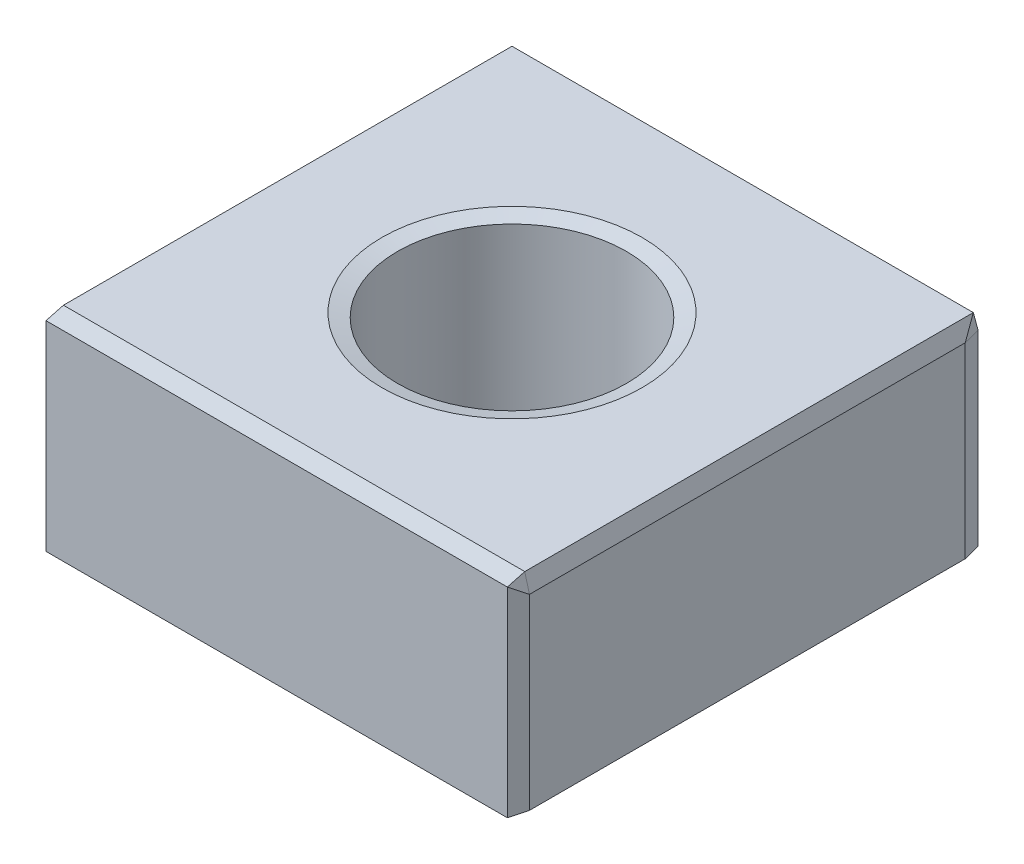
ISO-10303-21;
HEADER;
FILE_DESCRIPTION(('STEP AP214'),'2;1');
FILE_NAME('part.step','',(''),(''),'','','');
FILE_SCHEMA(('AUTOMOTIVE_DESIGN { 1 0 10303 214 1 1 1 1 }'));
ENDSEC;
DATA;
#1=APPLICATION_CONTEXT('core data for automotive mechanical design processes');
#2=APPLICATION_PROTOCOL_DEFINITION('international standard','automotive_design',2000,#1);
#3=PRODUCT_CONTEXT('',#1,'mechanical');
#4=PRODUCT('Part','Part','',(#3));
#5=PRODUCT_RELATED_PRODUCT_CATEGORY('part','',(#4));
#6=PRODUCT_DEFINITION_FORMATION('','',#4);
#7=PRODUCT_DEFINITION_CONTEXT('part definition',#1,'design');
#8=PRODUCT_DEFINITION('design','',#6,#7);
#9=PRODUCT_DEFINITION_SHAPE('','',#8);
#10=(LENGTH_UNIT() NAMED_UNIT(*) SI_UNIT(.MILLI.,.METRE.));
#11=(NAMED_UNIT(*) PLANE_ANGLE_UNIT() SI_UNIT($,.RADIAN.));
#12=(NAMED_UNIT(*) SI_UNIT($,.STERADIAN.) SOLID_ANGLE_UNIT());
#13=UNCERTAINTY_MEASURE_WITH_UNIT(LENGTH_MEASURE(1.E-05),#10,'distance_accuracy_value','');
#14=(GEOMETRIC_REPRESENTATION_CONTEXT(3) GLOBAL_UNCERTAINTY_ASSIGNED_CONTEXT((#13)) GLOBAL_UNIT_ASSIGNED_CONTEXT((#10,
#11,#12)) REPRESENTATION_CONTEXT('',''));
#15=CARTESIAN_POINT('',(0.,0.,0.));
#16=DIRECTION('',(0.,0.,1.));
#17=DIRECTION('',(1.,0.,0.));
#18=AXIS2_PLACEMENT_3D('',#15,#16,#17);
#19=CARTESIAN_POINT('',(-27.,24.,27.));
#20=DIRECTION('',(1.,0.,0.));
#21=DIRECTION('',(0.,0.,-1.));
#22=AXIS2_PLACEMENT_3D('',#19,#20,#21);
#23=PLANE('',#22);
#24=DIRECTION('',(0.,0.,-1.));
#25=VECTOR('',#24,1.);
#26=CARTESIAN_POINT('',(-27.,22.,-27.));
#27=LINE('',#26,#25);
#28=CARTESIAN_POINT('',(-27.,22.,25.));
#29=VERTEX_POINT('',#28);
#30=CARTESIAN_POINT('',(-27.,22.,-26.4641016151377));
#31=VERTEX_POINT('',#30);
#32=EDGE_CURVE('E136',#29,#31,#27,.T.);
#33=ORIENTED_EDGE('',*,*,#32,.T.);
#34=DIRECTION('',(0.,-1.,0.));
#35=VECTOR('',#34,1.);
#36=CARTESIAN_POINT('',(-27.,24.,-26.4641016151377));
#37=LINE('',#36,#35);
#38=CARTESIAN_POINT('',(-27.,0.535898384862246,-26.4641016151377));
#39=VERTEX_POINT('',#38);
#40=EDGE_CURVE('E181',#31,#39,#37,.T.);
#41=ORIENTED_EDGE('',*,*,#40,.T.);
#42=DIRECTION('',(0.,0.,1.));
#43=VECTOR('',#42,1.);
#44=CARTESIAN_POINT('',(-27.,0.535898384862246,27.));
#45=LINE('',#44,#43);
#46=CARTESIAN_POINT('',(-27.,0.535898384862246,25.));
#47=VERTEX_POINT('',#46);
#48=EDGE_CURVE('E172',#39,#47,#45,.T.);
#49=ORIENTED_EDGE('',*,*,#48,.T.);
#50=DIRECTION('',(0.,1.,0.));
#51=VECTOR('',#50,1.);
#52=CARTESIAN_POINT('',(-27.,24.,25.));
#53=LINE('',#52,#51);
#54=EDGE_CURVE('E168',#47,#29,#53,.T.);
#55=ORIENTED_EDGE('',*,*,#54,.T.);
#56=EDGE_LOOP('',(#33,#41,#49,#55));
#57=FACE_BOUND('',#56,.T.);
#58=ADVANCED_FACE('F39',(#57),#23,.F.);
#59=CARTESIAN_POINT('',(27.,24.,27.));
#60=DIRECTION('',(0.,0.,-1.));
#61=DIRECTION('',(-1.,0.,0.));
#62=AXIS2_PLACEMENT_3D('',#59,#60,#61);
#63=PLANE('',#62);
#64=DIRECTION('',(-1.,0.,0.));
#65=VECTOR('',#64,1.);
#66=CARTESIAN_POINT('',(-27.,23.4641016151378,27.));
#67=LINE('',#66,#65);
#68=CARTESIAN_POINT('',(26.4641016151378,23.4641016151378,27.));
#69=VERTEX_POINT('',#68);
#70=CARTESIAN_POINT('',(-26.4641016151377,23.4641016151378,27.));
#71=VERTEX_POINT('',#70);
#72=EDGE_CURVE('E55',#69,#71,#67,.T.);
#73=ORIENTED_EDGE('',*,*,#72,.T.);
#74=DIRECTION('',(0.,-1.,0.));
#75=VECTOR('',#74,1.);
#76=CARTESIAN_POINT('',(-26.4641016151377,24.,27.));
#77=LINE('',#76,#75);
#78=CARTESIAN_POINT('',(-26.4641016151377,0.535898384862246,27.));
#79=VERTEX_POINT('',#78);
#80=EDGE_CURVE('E230',#71,#79,#77,.T.);
#81=ORIENTED_EDGE('',*,*,#80,.T.);
#82=DIRECTION('',(1.,0.,0.));
#83=VECTOR('',#82,1.);
#84=CARTESIAN_POINT('',(27.,0.535898384862246,27.));
#85=LINE('',#84,#83);
#86=CARTESIAN_POINT('',(26.4641016151378,0.535898384862246,27.));
#87=VERTEX_POINT('',#86);
#88=EDGE_CURVE('E223',#79,#87,#85,.T.);
#89=ORIENTED_EDGE('',*,*,#88,.T.);
#90=DIRECTION('',(0.,1.,0.));
#91=VECTOR('',#90,1.);
#92=CARTESIAN_POINT('',(26.4641016151378,24.,27.));
#93=LINE('',#92,#91);
#94=EDGE_CURVE('E60',#87,#69,#93,.T.);
#95=ORIENTED_EDGE('',*,*,#94,.T.);
#96=EDGE_LOOP('',(#73,#81,#89,#95));
#97=FACE_BOUND('',#96,.T.);
#98=ADVANCED_FACE('F413',(#97),#63,.F.);
#99=CARTESIAN_POINT('',(27.,24.,27.));
#100=DIRECTION('',(-1.,0.,0.));
#101=DIRECTION('',(0.,0.,1.));
#102=AXIS2_PLACEMENT_3D('',#99,#100,#101);
#103=PLANE('',#102);
#104=DIRECTION('',(0.,1.,0.));
#105=VECTOR('',#104,1.);
#106=CARTESIAN_POINT('',(27.,24.,-25.));
#107=LINE('',#106,#105);
#108=CARTESIAN_POINT('',(27.,0.535898384862246,-25.));
#109=VERTEX_POINT('',#108);
#110=CARTESIAN_POINT('',(27.,22.,-25.));
#111=VERTEX_POINT('',#110);
#112=EDGE_CURVE('E216',#109,#111,#107,.T.);
#113=ORIENTED_EDGE('',*,*,#112,.T.);
#114=DIRECTION('',(0.,0.,1.));
#115=VECTOR('',#114,1.);
#116=CARTESIAN_POINT('',(27.,22.,27.));
#117=LINE('',#116,#115);
#118=CARTESIAN_POINT('',(27.,22.,25.));
#119=VERTEX_POINT('',#118);
#120=EDGE_CURVE('E219',#111,#119,#117,.T.);
#121=ORIENTED_EDGE('',*,*,#120,.T.);
#122=DIRECTION('',(0.,-1.,0.));
#123=VECTOR('',#122,1.);
#124=CARTESIAN_POINT('',(27.,24.,25.));
#125=LINE('',#124,#123);
#126=CARTESIAN_POINT('',(27.,0.535898384862246,25.));
#127=VERTEX_POINT('',#126);
#128=EDGE_CURVE('E210',#119,#127,#125,.T.);
#129=ORIENTED_EDGE('',*,*,#128,.T.);
#130=DIRECTION('',(0.,0.,-1.));
#131=VECTOR('',#130,1.);
#132=CARTESIAN_POINT('',(27.,0.535898384862246,27.));
#133=LINE('',#132,#131);
#134=EDGE_CURVE('E213',#127,#109,#133,.T.);
#135=ORIENTED_EDGE('',*,*,#134,.T.);
#136=EDGE_LOOP('',(#113,#121,#129,#135));
#137=FACE_BOUND('',#136,.T.);
#138=ADVANCED_FACE('F411',(#137),#103,.F.);
#139=CARTESIAN_POINT('',(27.,24.,-27.));
#140=DIRECTION('',(0.,0.,1.));
#141=DIRECTION('',(1.,0.,0.));
#142=AXIS2_PLACEMENT_3D('',#139,#140,#141);
#143=PLANE('',#142);
#144=DIRECTION('',(0.,1.,0.));
#145=VECTOR('',#144,1.);
#146=CARTESIAN_POINT('',(-25.,24.,-27.));
#147=LINE('',#146,#145);
#148=CARTESIAN_POINT('',(-25.,0.535898384862246,-27.));
#149=VERTEX_POINT('',#148);
#150=CARTESIAN_POINT('',(-25.,22.,-27.));
#151=VERTEX_POINT('',#150);
#152=EDGE_CURVE('E203',#149,#151,#147,.T.);
#153=ORIENTED_EDGE('',*,*,#152,.T.);
#154=DIRECTION('',(1.,0.,0.));
#155=VECTOR('',#154,1.);
#156=CARTESIAN_POINT('',(27.,22.,-27.));
#157=LINE('',#156,#155);
#158=CARTESIAN_POINT('',(26.4641016151378,22.,-27.));
#159=VERTEX_POINT('',#158);
#160=EDGE_CURVE('E206',#151,#159,#157,.T.);
#161=ORIENTED_EDGE('',*,*,#160,.T.);
#162=DIRECTION('',(0.,-1.,0.));
#163=VECTOR('',#162,1.);
#164=CARTESIAN_POINT('',(26.4641016151378,24.,-27.));
#165=LINE('',#164,#163);
#166=CARTESIAN_POINT('',(26.4641016151378,0.535898384862246,-27.));
#167=VERTEX_POINT('',#166);
#168=EDGE_CURVE('E197',#159,#167,#165,.T.);
#169=ORIENTED_EDGE('',*,*,#168,.T.);
#170=DIRECTION('',(-1.,0.,0.));
#171=VECTOR('',#170,1.);
#172=CARTESIAN_POINT('',(27.,0.535898384862246,-27.));
#173=LINE('',#172,#171);
#174=EDGE_CURVE('E200',#167,#149,#173,.T.);
#175=ORIENTED_EDGE('',*,*,#174,.T.);
#176=EDGE_LOOP('',(#153,#161,#169,#175));
#177=FACE_BOUND('',#176,.T.);
#178=ADVANCED_FACE('F373',(#177),#143,.F.);
#179=CARTESIAN_POINT('',(0.,24.,0.));
#180=DIRECTION('',(0.,1.,0.));
#181=DIRECTION('',(0.,0.,1.));
#182=AXIS2_PLACEMENT_3D('',#179,#180,#181);
#183=PLANE('',#182);
#184=CARTESIAN_POINT('',(0.,24.,0.));
#185=DIRECTION('',(0.,1.,0.));
#186=DIRECTION('',(0.,0.,1.));
#187=AXIS2_PLACEMENT_3D('',#184,#185,#186);
#188=CIRCLE('',#187,14.93);
#189=CARTESIAN_POINT('',(0.,24.,14.93));
#190=VERTEX_POINT('',#189);
#191=EDGE_CURVE('E48',#190,#190,#188,.F.);
#192=ORIENTED_EDGE('',*,*,#191,.T.);
#193=EDGE_LOOP('',(#192));
#194=FACE_BOUND('',#193,.T.);
#195=DIRECTION('',(-1.,0.,0.));
#196=VECTOR('',#195,1.);
#197=CARTESIAN_POINT('',(-27.,24.,-26.4641016151377));
#198=LINE('',#197,#196);
#199=CARTESIAN_POINT('',(26.4641016151378,24.,-26.4641016151378));
#200=VERTEX_POINT('',#199);
#201=CARTESIAN_POINT('',(-26.4641016151377,24.,-26.4641016151377));
#202=VERTEX_POINT('',#201);
#203=EDGE_CURVE('E165',#200,#202,#198,.T.);
#204=ORIENTED_EDGE('',*,*,#203,.T.);
#205=DIRECTION('',(0.,0.,1.));
#206=VECTOR('',#205,1.);
#207=CARTESIAN_POINT('',(-26.4641016151377,24.,27.));
#208=LINE('',#207,#206);
#209=CARTESIAN_POINT('',(-26.4641016151377,24.,25.));
#210=VERTEX_POINT('',#209);
#211=EDGE_CURVE('E134',#202,#210,#208,.T.);
#212=ORIENTED_EDGE('',*,*,#211,.T.);
#213=DIRECTION('',(1.,0.,0.));
#214=VECTOR('',#213,1.);
#215=CARTESIAN_POINT('',(27.,24.,25.));
#216=LINE('',#215,#214);
#217=CARTESIAN_POINT('',(26.4641016151378,24.,25.));
#218=VERTEX_POINT('',#217);
#219=EDGE_CURVE('E153',#210,#218,#216,.T.);
#220=ORIENTED_EDGE('',*,*,#219,.T.);
#221=DIRECTION('',(0.,0.,-1.));
#222=VECTOR('',#221,1.);
#223=CARTESIAN_POINT('',(26.4641016151378,24.,-27.));
#224=LINE('',#223,#222);
#225=EDGE_CURVE('E160',#218,#200,#224,.T.);
#226=ORIENTED_EDGE('',*,*,#225,.T.);
#227=EDGE_LOOP('',(#204,#212,#220,#226));
#228=FACE_BOUND('',#227,.T.);
#229=ADVANCED_FACE('F163',(#194,#228),#183,.T.);
#230=CARTESIAN_POINT('',(0.,0.,0.));
#231=DIRECTION('',(0.,1.,0.));
#232=DIRECTION('',(0.,0.,1.));
#233=AXIS2_PLACEMENT_3D('',#230,#231,#232);
#234=PLANE('',#233);
#235=CARTESIAN_POINT('',(0.,0.,0.));
#236=DIRECTION('',(0.,1.,0.));
#237=DIRECTION('',(0.,0.,1.));
#238=AXIS2_PLACEMENT_3D('',#235,#236,#237);
#239=CIRCLE('',#238,13.612308546376);
#240=CARTESIAN_POINT('',(0.,0.,-13.612308546376));
#241=VERTEX_POINT('',#240);
#242=EDGE_CURVE('E11',#241,#241,#239,.T.);
#243=ORIENTED_EDGE('',*,*,#242,.T.);
#244=EDGE_LOOP('',(#243));
#245=FACE_BOUND('',#244,.T.);
#246=DIRECTION('',(-1.,0.,0.));
#247=VECTOR('',#246,1.);
#248=CARTESIAN_POINT('',(0.,0.,25.));
#249=LINE('',#248,#247);
#250=CARTESIAN_POINT('',(25.,0.,25.));
#251=VERTEX_POINT('',#250);
#252=CARTESIAN_POINT('',(-25.,0.,25.));
#253=VERTEX_POINT('',#252);
#254=EDGE_CURVE('E184',#251,#253,#249,.T.);
#255=ORIENTED_EDGE('',*,*,#254,.T.);
#256=DIRECTION('',(0.,0.,-1.));
#257=VECTOR('',#256,1.);
#258=CARTESIAN_POINT('',(-25.,0.,0.));
#259=LINE('',#258,#257);
#260=CARTESIAN_POINT('',(-25.,0.,-25.));
#261=VERTEX_POINT('',#260);
#262=EDGE_CURVE('E193',#253,#261,#259,.T.);
#263=ORIENTED_EDGE('',*,*,#262,.T.);
#264=DIRECTION('',(1.,0.,0.));
#265=VECTOR('',#264,1.);
#266=CARTESIAN_POINT('',(0.,0.,-25.));
#267=LINE('',#266,#265);
#268=CARTESIAN_POINT('',(25.,0.,-25.));
#269=VERTEX_POINT('',#268);
#270=EDGE_CURVE('E190',#261,#269,#267,.T.);
#271=ORIENTED_EDGE('',*,*,#270,.T.);
#272=DIRECTION('',(0.,0.,1.));
#273=VECTOR('',#272,1.);
#274=CARTESIAN_POINT('',(25.,0.,0.));
#275=LINE('',#274,#273);
#276=EDGE_CURVE('E187',#269,#251,#275,.T.);
#277=ORIENTED_EDGE('',*,*,#276,.T.);
#278=EDGE_LOOP('',(#255,#263,#271,#277));
#279=FACE_BOUND('',#278,.T.);
#280=ADVANCED_FACE('F336',(#245,#279),#234,.F.);
#281=CARTESIAN_POINT('',(27.,0.535898384862246,27.));
#282=DIRECTION('',(-0.258819045102518,0.965925826289069,0.));
#283=DIRECTION('',(0.,0.,-1.));
#284=AXIS2_PLACEMENT_3D('',#281,#282,#283);
#285=PLANE('',#284);
#286=DIRECTION('',(0.965925826289069,0.258819045102518,0.));
#287=VECTOR('',#286,1.);
#288=CARTESIAN_POINT('',(25.,0.,-25.));
#289=LINE('',#288,#287);
#290=EDGE_CURVE('E161',#109,#269,#289,.F.);
#291=ORIENTED_EDGE('',*,*,#290,.F.);
#292=ORIENTED_EDGE('',*,*,#134,.F.);
#293=DIRECTION('',(-0.965925826289069,-0.258819045102518,0.));
#294=VECTOR('',#293,1.);
#295=CARTESIAN_POINT('',(25.,0.,25.));
#296=LINE('',#295,#294);
#297=EDGE_CURVE('E303',#251,#127,#296,.F.);
#298=ORIENTED_EDGE('',*,*,#297,.F.);
#299=ORIENTED_EDGE('',*,*,#276,.F.);
#300=EDGE_LOOP('',(#291,#292,#298,#299));
#301=FACE_BOUND('',#300,.T.);
#302=ADVANCED_FACE('F339',(#301),#285,.F.);
#303=CARTESIAN_POINT('',(25.,0.,-25.));
#304=DIRECTION('',(0.258198889747158,-0.963611374994281,-0.0691841839943625));
#305=DIRECTION('',(0.965925826289069,0.258819045102518,0.));
#306=AXIS2_PLACEMENT_3D('',#303,#304,#305);
#307=PLANE('',#306);
#308=DIRECTION('',(-0.258819045102518,0.,-0.965925826289069));
#309=VECTOR('',#308,1.);
#310=CARTESIAN_POINT('',(26.8660254037844,0.535898384862246,-25.5));
#311=LINE('',#310,#309);
#312=EDGE_CURVE('E295',#109,#167,#311,.T.);
#313=ORIENTED_EDGE('',*,*,#312,.F.);
#314=ORIENTED_EDGE('',*,*,#290,.T.);
#315=DIRECTION('',(-0.577350269189628,-0.211324865405184,0.788675134594812));
#316=VECTOR('',#315,1.);
#317=CARTESIAN_POINT('',(25.,0.,-25.));
#318=LINE('',#317,#316);
#319=EDGE_CURVE('E299',#167,#269,#318,.T.);
#320=ORIENTED_EDGE('',*,*,#319,.F.);
#321=EDGE_LOOP('',(#313,#314,#320));
#322=FACE_BOUND('',#321,.T.);
#323=ADVANCED_FACE('F390',(#322),#307,.T.);
#324=CARTESIAN_POINT('',(25.,0.,25.));
#325=DIRECTION('',(0.258198889747158,-0.963611374994281,0.0691841839943625));
#326=DIRECTION('',(0.965925826289069,0.258819045102518,0.));
#327=AXIS2_PLACEMENT_3D('',#324,#325,#326);
#328=PLANE('',#327);
#329=DIRECTION('',(0.577350269189628,0.211324865405184,0.788675134594812));
#330=VECTOR('',#329,1.);
#331=CARTESIAN_POINT('',(25.,0.,25.));
#332=LINE('',#331,#330);
#333=EDGE_CURVE('E287',#251,#87,#332,.T.);
#334=ORIENTED_EDGE('',*,*,#333,.F.);
#335=ORIENTED_EDGE('',*,*,#297,.T.);
#336=DIRECTION('',(0.258819045102518,0.,-0.965925826289069));
#337=VECTOR('',#336,1.);
#338=CARTESIAN_POINT('',(26.8660254037844,0.535898384862246,25.5));
#339=LINE('',#338,#337);
#340=EDGE_CURVE('E291',#87,#127,#339,.T.);
#341=ORIENTED_EDGE('',*,*,#340,.F.);
#342=EDGE_LOOP('',(#334,#335,#341));
#343=FACE_BOUND('',#342,.T.);
#344=ADVANCED_FACE('F399',(#343),#328,.T.);
#345=CARTESIAN_POINT('',(27.,0.535898384862246,-27.));
#346=DIRECTION('',(0.,0.965925826289069,0.258819045102518));
#347=DIRECTION('',(-1.,0.,0.));
#348=AXIS2_PLACEMENT_3D('',#345,#346,#347);
#349=PLANE('',#348);
#350=ORIENTED_EDGE('',*,*,#319,.T.);
#351=ORIENTED_EDGE('',*,*,#270,.F.);
#352=DIRECTION('',(0.,0.258819045102518,-0.965925826289069));
#353=VECTOR('',#352,1.);
#354=CARTESIAN_POINT('',(-25.,0.,-25.));
#355=LINE('',#354,#353);
#356=EDGE_CURVE('E280',#149,#261,#355,.F.);
#357=ORIENTED_EDGE('',*,*,#356,.F.);
#358=ORIENTED_EDGE('',*,*,#174,.F.);
#359=EDGE_LOOP('',(#350,#351,#357,#358));
#360=FACE_BOUND('',#359,.T.);
#361=ADVANCED_FACE('F393',(#360),#349,.F.);
#362=CARTESIAN_POINT('',(26.4641016151378,24.,-27.));
#363=DIRECTION('',(-0.965925826289069,0.,0.258819045102518));
#364=DIRECTION('',(0.,-1.,0.));
#365=AXIS2_PLACEMENT_3D('',#362,#363,#364);
#366=PLANE('',#365);
#367=ORIENTED_EDGE('',*,*,#312,.T.);
#368=ORIENTED_EDGE('',*,*,#168,.F.);
#369=DIRECTION('',(0.258819045102518,0.,0.965925826289069));
#370=VECTOR('',#369,1.);
#371=CARTESIAN_POINT('',(26.4641016151378,22.,-27.));
#372=LINE('',#371,#370);
#373=EDGE_CURVE('E276',#111,#159,#372,.F.);
#374=ORIENTED_EDGE('',*,*,#373,.F.);
#375=ORIENTED_EDGE('',*,*,#112,.F.);
#376=EDGE_LOOP('',(#367,#368,#374,#375));
#377=FACE_BOUND('',#376,.T.);
#378=ADVANCED_FACE('F386',(#377),#366,.F.);
#379=CARTESIAN_POINT('',(26.4641016151378,24.,0.));
#380=DIRECTION('',(0.965925826289069,0.258819045102517,0.));
#381=DIRECTION('',(0.,0.,1.));
#382=AXIS2_PLACEMENT_3D('',#379,#380,#381);
#383=PLANE('',#382);
#384=DIRECTION('',(-0.258819045102517,0.965925826289069,0.));
#385=VECTOR('',#384,1.);
#386=CARTESIAN_POINT('',(27.,22.,25.));
#387=LINE('',#386,#385);
#388=EDGE_CURVE('E268',#119,#218,#387,.T.);
#389=ORIENTED_EDGE('',*,*,#388,.F.);
#390=ORIENTED_EDGE('',*,*,#120,.F.);
#391=DIRECTION('',(0.211324865405183,-0.788675134594811,0.57735026918963));
#392=VECTOR('',#391,1.);
#393=CARTESIAN_POINT('',(26.7320508075689,23.,-25.7320508075689));
#394=LINE('',#393,#392);
#395=EDGE_CURVE('E272',#200,#111,#394,.T.);
#396=ORIENTED_EDGE('',*,*,#395,.F.);
#397=ORIENTED_EDGE('',*,*,#225,.F.);
#398=EDGE_LOOP('',(#389,#390,#396,#397));
#399=FACE_BOUND('',#398,.T.);
#400=ADVANCED_FACE('F408',(#399),#383,.T.);
#401=CARTESIAN_POINT('',(27.,24.,25.));
#402=DIRECTION('',(-0.965925826289069,0.,-0.258819045102518));
#403=DIRECTION('',(0.,-1.,0.));
#404=AXIS2_PLACEMENT_3D('',#401,#402,#403);
#405=PLANE('',#404);
#406=ORIENTED_EDGE('',*,*,#340,.T.);
#407=ORIENTED_EDGE('',*,*,#128,.F.);
#408=DIRECTION('',(-0.211324865405184,0.577350269189628,0.788675134594812));
#409=VECTOR('',#408,1.);
#410=CARTESIAN_POINT('',(27.,22.,25.));
#411=LINE('',#410,#409);
#412=EDGE_CURVE('E265',#69,#119,#411,.F.);
#413=ORIENTED_EDGE('',*,*,#412,.F.);
#414=ORIENTED_EDGE('',*,*,#94,.F.);
#415=EDGE_LOOP('',(#406,#407,#413,#414));
#416=FACE_BOUND('',#415,.T.);
#417=ADVANCED_FACE('F402',(#416),#405,.F.);
#418=CARTESIAN_POINT('',(27.,0.535898384862246,27.));
#419=DIRECTION('',(0.,0.965925826289069,-0.258819045102518));
#420=DIRECTION('',(1.,0.,0.));
#421=AXIS2_PLACEMENT_3D('',#418,#419,#420);
#422=PLANE('',#421);
#423=ORIENTED_EDGE('',*,*,#333,.T.);
#424=ORIENTED_EDGE('',*,*,#88,.F.);
#425=DIRECTION('',(0.577350269189627,-0.211324865405184,-0.788675134594813));
#426=VECTOR('',#425,1.);
#427=CARTESIAN_POINT('',(-25.7320508075689,0.267949192431123,26.));
#428=LINE('',#427,#426);
#429=EDGE_CURVE('E261',#253,#79,#428,.F.);
#430=ORIENTED_EDGE('',*,*,#429,.F.);
#431=ORIENTED_EDGE('',*,*,#254,.F.);
#432=EDGE_LOOP('',(#423,#424,#430,#431));
#433=FACE_BOUND('',#432,.T.);
#434=ADVANCED_FACE('F355',(#433),#422,.F.);
#435=CARTESIAN_POINT('',(-27.,0.535898384862246,27.));
#436=DIRECTION('',(0.258819045102518,0.965925826289069,0.));
#437=DIRECTION('',(0.,0.,1.));
#438=AXIS2_PLACEMENT_3D('',#435,#436,#437);
#439=PLANE('',#438);
#440=DIRECTION('',(0.788675134594812,-0.211324865405184,0.577350269189628));
#441=VECTOR('',#440,1.);
#442=CARTESIAN_POINT('',(-25.,0.,-25.));
#443=LINE('',#442,#441);
#444=EDGE_CURVE('E283',#261,#39,#443,.F.);
#445=ORIENTED_EDGE('',*,*,#444,.F.);
#446=ORIENTED_EDGE('',*,*,#262,.F.);
#447=DIRECTION('',(-0.965925826289069,0.258819045102518,0.));
#448=VECTOR('',#447,1.);
#449=CARTESIAN_POINT('',(-27.,0.535898384862246,25.));
#450=LINE('',#449,#448);
#451=EDGE_CURVE('E257',#47,#253,#450,.F.);
#452=ORIENTED_EDGE('',*,*,#451,.F.);
#453=ORIENTED_EDGE('',*,*,#48,.F.);
#454=EDGE_LOOP('',(#445,#446,#452,#453));
#455=FACE_BOUND('',#454,.T.);
#456=ADVANCED_FACE('F350',(#455),#439,.F.);
#457=CARTESIAN_POINT('',(-25.,0.,-25.));
#458=DIRECTION('',(-0.0691841839943625,-0.963611374994281,-0.258198889747158));
#459=DIRECTION('',(0.,0.258819045102518,-0.965925826289069));
#460=AXIS2_PLACEMENT_3D('',#457,#458,#459);
#461=PLANE('',#460);
#462=ORIENTED_EDGE('',*,*,#356,.T.);
#463=ORIENTED_EDGE('',*,*,#444,.T.);
#464=DIRECTION('',(-0.965925826289069,0.,0.258819045102518));
#465=VECTOR('',#464,1.);
#466=CARTESIAN_POINT('',(-25.5,0.535898384862246,-26.8660254037844));
#467=LINE('',#466,#465);
#468=EDGE_CURVE('E253',#149,#39,#467,.T.);
#469=ORIENTED_EDGE('',*,*,#468,.F.);
#470=EDGE_LOOP('',(#462,#463,#469));
#471=FACE_BOUND('',#470,.T.);
#472=ADVANCED_FACE('F365',(#471),#461,.T.);
#473=CARTESIAN_POINT('',(26.4641016151378,22.,-27.));
#474=DIRECTION('',(0.963611374994281,0.0691841839943609,-0.258198889747158));
#475=DIRECTION('',(-0.258819045102518,0.,-0.965925826289069));
#476=AXIS2_PLACEMENT_3D('',#473,#474,#475);
#477=PLANE('',#476);
#478=ORIENTED_EDGE('',*,*,#395,.T.);
#479=ORIENTED_EDGE('',*,*,#373,.T.);
#480=DIRECTION('',(0.,0.965925826289069,0.258819045102518));
#481=VECTOR('',#480,1.);
#482=CARTESIAN_POINT('',(26.4641016151378,22.,-27.));
#483=LINE('',#482,#481);
#484=EDGE_CURVE('E250',#200,#159,#483,.F.);
#485=ORIENTED_EDGE('',*,*,#484,.F.);
#486=EDGE_LOOP('',(#478,#479,#485));
#487=FACE_BOUND('',#486,.T.);
#488=ADVANCED_FACE('F382',(#487),#477,.T.);
#489=CARTESIAN_POINT('',(27.,22.,25.));
#490=DIRECTION('',(0.963611374994282,0.258198889747156,0.0691841839943638));
#491=DIRECTION('',(-0.258819045102516,0.96592582628907,0.));
#492=AXIS2_PLACEMENT_3D('',#489,#490,#491);
#493=PLANE('',#492);
#494=ORIENTED_EDGE('',*,*,#412,.T.);
#495=ORIENTED_EDGE('',*,*,#388,.T.);
#496=DIRECTION('',(0.,-0.258819045102518,0.965925826289069));
#497=VECTOR('',#496,1.);
#498=CARTESIAN_POINT('',(26.4641016151378,23.8660254037844,25.5));
#499=LINE('',#498,#497);
#500=EDGE_CURVE('E156',#69,#218,#499,.F.);
#501=ORIENTED_EDGE('',*,*,#500,.F.);
#502=EDGE_LOOP('',(#494,#495,#501));
#503=FACE_BOUND('',#502,.T.);
#504=ADVANCED_FACE('F405',(#503),#493,.T.);
#505=CARTESIAN_POINT('',(-27.,0.535898384862246,25.));
#506=DIRECTION('',(-0.258198889747158,-0.963611374994281,0.069184183994363));
#507=DIRECTION('',(0.965925826289069,-0.258819045102518,0.));
#508=AXIS2_PLACEMENT_3D('',#505,#506,#507);
#509=PLANE('',#508);
#510=ORIENTED_EDGE('',*,*,#451,.T.);
#511=ORIENTED_EDGE('',*,*,#429,.T.);
#512=DIRECTION('',(0.258819045102519,0.,0.965925826289069));
#513=VECTOR('',#512,1.);
#514=CARTESIAN_POINT('',(-27.,0.535898384862246,25.));
#515=LINE('',#514,#513);
#516=EDGE_CURVE('E245',#47,#79,#515,.T.);
#517=ORIENTED_EDGE('',*,*,#516,.F.);
#518=EDGE_LOOP('',(#510,#511,#517));
#519=FACE_BOUND('',#518,.T.);
#520=ADVANCED_FACE('F357',(#519),#509,.T.);
#521=CARTESIAN_POINT('',(-27.,24.,-26.4641016151377));
#522=DIRECTION('',(0.258819045102518,0.,0.965925826289069));
#523=DIRECTION('',(0.,-1.,0.));
#524=AXIS2_PLACEMENT_3D('',#521,#522,#523);
#525=PLANE('',#524);
#526=ORIENTED_EDGE('',*,*,#468,.T.);
#527=ORIENTED_EDGE('',*,*,#40,.F.);
#528=DIRECTION('',(0.965925826289069,0.,-0.258819045102518));
#529=VECTOR('',#528,1.);
#530=CARTESIAN_POINT('',(-27.,22.,-26.4641016151377));
#531=LINE('',#530,#529);
#532=EDGE_CURVE('E241',#151,#31,#531,.F.);
#533=ORIENTED_EDGE('',*,*,#532,.F.);
#534=ORIENTED_EDGE('',*,*,#152,.F.);
#535=EDGE_LOOP('',(#526,#527,#533,#534));
#536=FACE_BOUND('',#535,.T.);
#537=ADVANCED_FACE('F369',(#536),#525,.F.);
#538=CARTESIAN_POINT('',(0.,24.,-26.4641016151378));
#539=DIRECTION('',(0.,0.258819045102518,-0.965925826289069));
#540=DIRECTION('',(1.,0.,0.));
#541=AXIS2_PLACEMENT_3D('',#538,#539,#540);
#542=PLANE('',#541);
#543=ORIENTED_EDGE('',*,*,#484,.T.);
#544=ORIENTED_EDGE('',*,*,#160,.F.);
#545=DIRECTION('',(0.577350269189628,-0.788675134594812,-0.211324865405184));
#546=VECTOR('',#545,1.);
#547=CARTESIAN_POINT('',(-25.7320508075689,23.,-26.7320508075689));
#548=LINE('',#547,#546);
#549=EDGE_CURVE('E150',#202,#151,#548,.T.);
#550=ORIENTED_EDGE('',*,*,#549,.F.);
#551=ORIENTED_EDGE('',*,*,#203,.F.);
#552=EDGE_LOOP('',(#543,#544,#550,#551));
#553=FACE_BOUND('',#552,.T.);
#554=ADVANCED_FACE('F376',(#553),#542,.T.);
#555=CARTESIAN_POINT('',(0.,24.,25.));
#556=DIRECTION('',(0.,0.965925826289069,0.258819045102518));
#557=DIRECTION('',(-1.,0.,0.));
#558=AXIS2_PLACEMENT_3D('',#555,#556,#557);
#559=PLANE('',#558);
#560=ORIENTED_EDGE('',*,*,#500,.T.);
#561=ORIENTED_EDGE('',*,*,#219,.F.);
#562=DIRECTION('',(0.,0.258819045102518,-0.965925826289069));
#563=VECTOR('',#562,1.);
#564=CARTESIAN_POINT('',(-26.4641016151377,24.,25.));
#565=LINE('',#564,#563);
#566=EDGE_CURVE('E143',#71,#210,#565,.T.);
#567=ORIENTED_EDGE('',*,*,#566,.F.);
#568=ORIENTED_EDGE('',*,*,#72,.F.);
#569=EDGE_LOOP('',(#560,#561,#567,#568));
#570=FACE_BOUND('',#569,.T.);
#571=ADVANCED_FACE('F154',(#570),#559,.T.);
#572=CARTESIAN_POINT('',(-26.4641016151377,24.,27.));
#573=DIRECTION('',(0.965925826289069,0.,-0.258819045102519));
#574=DIRECTION('',(0.,-1.,0.));
#575=AXIS2_PLACEMENT_3D('',#572,#573,#574);
#576=PLANE('',#575);
#577=ORIENTED_EDGE('',*,*,#516,.T.);
#578=ORIENTED_EDGE('',*,*,#80,.F.);
#579=DIRECTION('',(-0.211324865405185,-0.577350269189628,-0.788675134594812));
#580=VECTOR('',#579,1.);
#581=CARTESIAN_POINT('',(-26.7320508075689,22.7320508075689,26.));
#582=LINE('',#581,#580);
#583=EDGE_CURVE('E147',#29,#71,#582,.F.);
#584=ORIENTED_EDGE('',*,*,#583,.F.);
#585=ORIENTED_EDGE('',*,*,#54,.F.);
#586=EDGE_LOOP('',(#577,#578,#584,#585));
#587=FACE_BOUND('',#586,.T.);
#588=ADVANCED_FACE('F360',(#587),#576,.F.);
#589=CARTESIAN_POINT('',(-27.,22.,-26.4641016151377));
#590=DIRECTION('',(-0.258198889747158,0.0691841839943625,-0.963611374994281));
#591=DIRECTION('',(-0.965925826289069,0.,0.258819045102518));
#592=AXIS2_PLACEMENT_3D('',#589,#590,#591);
#593=PLANE('',#592);
#594=ORIENTED_EDGE('',*,*,#549,.T.);
#595=ORIENTED_EDGE('',*,*,#532,.T.);
#596=DIRECTION('',(0.258819045102518,0.965925826289069,0.));
#597=VECTOR('',#596,1.);
#598=CARTESIAN_POINT('',(-27.,22.,-26.4641016151377));
#599=LINE('',#598,#597);
#600=EDGE_CURVE('E140',#202,#31,#599,.F.);
#601=ORIENTED_EDGE('',*,*,#600,.F.);
#602=EDGE_LOOP('',(#594,#595,#601));
#603=FACE_BOUND('',#602,.T.);
#604=ADVANCED_FACE('F430',(#603),#593,.T.);
#605=CARTESIAN_POINT('',(-26.4641016151377,24.,25.));
#606=DIRECTION('',(-0.963611374994281,0.258198889747158,0.0691841839943642));
#607=DIRECTION('',(-0.258819045102518,-0.965925826289069,0.));
#608=AXIS2_PLACEMENT_3D('',#605,#606,#607);
#609=PLANE('',#608);
#610=ORIENTED_EDGE('',*,*,#583,.T.);
#611=ORIENTED_EDGE('',*,*,#566,.T.);
#612=DIRECTION('',(-0.258819045102518,-0.965925826289069,0.));
#613=VECTOR('',#612,1.);
#614=CARTESIAN_POINT('',(-26.4641016151377,24.,25.));
#615=LINE('',#614,#613);
#616=EDGE_CURVE('E130',#29,#210,#615,.F.);
#617=ORIENTED_EDGE('',*,*,#616,.F.);
#618=EDGE_LOOP('',(#610,#611,#617));
#619=FACE_BOUND('',#618,.T.);
#620=ADVANCED_FACE('F145',(#619),#609,.T.);
#621=CARTESIAN_POINT('',(-26.4641016151377,24.,0.));
#622=DIRECTION('',(-0.965925826289069,0.258819045102518,0.));
#623=DIRECTION('',(0.,0.,-1.));
#624=AXIS2_PLACEMENT_3D('',#621,#622,#623);
#625=PLANE('',#624);
#626=ORIENTED_EDGE('',*,*,#600,.T.);
#627=ORIENTED_EDGE('',*,*,#32,.F.);
#628=ORIENTED_EDGE('',*,*,#616,.T.);
#629=ORIENTED_EDGE('',*,*,#211,.F.);
#630=EDGE_LOOP('',(#626,#627,#628,#629));
#631=FACE_BOUND('',#630,.T.);
#632=ADVANCED_FACE('F132',(#631),#625,.T.);
#633=CARTESIAN_POINT('',(0.,24.,0.));
#634=DIRECTION('',(0.,1.,0.));
#635=DIRECTION('',(0.,0.,1.));
#636=AXIS2_PLACEMENT_3D('',#633,#634,#635);
#637=CYLINDRICAL_SURFACE('',#636,13.13);
#638=CARTESIAN_POINT('',(0.,23.517691453624,0.));
#639=DIRECTION('',(0.,1.,0.));
#640=DIRECTION('',(0.,0.,1.));
#641=AXIS2_PLACEMENT_3D('',#638,#639,#640);
#642=CIRCLE('',#641,13.13);
#643=CARTESIAN_POINT('',(0.,23.517691453624,13.13));
#644=VERTEX_POINT('',#643);
#645=EDGE_CURVE('E313',#644,#644,#642,.T.);
#646=ORIENTED_EDGE('',*,*,#645,.T.);
#647=EDGE_LOOP('',(#646));
#648=FACE_BOUND('',#647,.T.);
#649=CARTESIAN_POINT('',(0.,1.80000000000002,0.));
#650=DIRECTION('',(0.,1.,0.));
#651=DIRECTION('',(0.,0.,1.));
#652=AXIS2_PLACEMENT_3D('',#649,#650,#651);
#653=CIRCLE('',#652,13.13);
#654=CARTESIAN_POINT('',(0.,1.80000000000002,-13.13));
#655=VERTEX_POINT('',#654);
#656=EDGE_CURVE('E232',#655,#655,#653,.F.);
#657=ORIENTED_EDGE('',*,*,#656,.T.);
#658=EDGE_LOOP('',(#657));
#659=FACE_BOUND('',#658,.T.);
#660=ADVANCED_FACE('F324',(#648,#659),#637,.F.);
#661=CARTESIAN_POINT('',(0.,23.517691453624,0.));
#662=DIRECTION('',(0.,1.,0.));
#663=DIRECTION('',(0.,0.,1.));
#664=AXIS2_PLACEMENT_3D('',#661,#662,#663);
#665=CONICAL_SURFACE('',#664,13.13,1.30899693899575);
#666=ORIENTED_EDGE('',*,*,#191,.F.);
#667=EDGE_LOOP('',(#666));
#668=FACE_BOUND('',#667,.T.);
#669=ORIENTED_EDGE('',*,*,#645,.F.);
#670=EDGE_LOOP('',(#669));
#671=FACE_BOUND('',#670,.T.);
#672=ADVANCED_FACE('F321',(#668,#671),#665,.F.);
#673=CARTESIAN_POINT('',(0.,0.,0.));
#674=DIRECTION('',(0.,-1.,0.));
#675=DIRECTION('',(0.,0.,-1.));
#676=AXIS2_PLACEMENT_3D('',#673,#674,#675);
#677=CONICAL_SURFACE('',#676,13.612308546376,0.261799387799146);
#678=CARTESIAN_POINT('',(0.,1.80000000000002,-13.13));
#679=CARTESIAN_POINT('',(0.,1.78125000000002,-13.1350240473581));
#680=CARTESIAN_POINT('',(0.,1.76250000000002,-13.1400480947162));
#681=CARTESIAN_POINT('',(0.,1.72500000000002,-13.1500961894323));
#682=CARTESIAN_POINT('',(0.,1.70625000000002,-13.1551202367904));
#683=CARTESIAN_POINT('',(0.,1.66875000000002,-13.1651683315066));
#684=CARTESIAN_POINT('',(0.,1.65000000000002,-13.1701923788647));
#685=CARTESIAN_POINT('',(0.,1.61250000000001,-13.1802404735808));
#686=CARTESIAN_POINT('',(0.,1.59375000000001,-13.1852645209389));
#687=CARTESIAN_POINT('',(0.,1.55625000000001,-13.1953126156551));
#688=CARTESIAN_POINT('',(0.,1.53750000000001,-13.2003366630132));
#689=CARTESIAN_POINT('',(0.,1.50000000000001,-13.2103847577293));
#690=CARTESIAN_POINT('',(0.,1.48125000000001,-13.2154088050874));
#691=CARTESIAN_POINT('',(0.,1.44375000000001,-13.2254568998036));
#692=CARTESIAN_POINT('',(0.,1.42500000000001,-13.2304809471617));
#693=CARTESIAN_POINT('',(0.,1.38750000000001,-13.2405290418778));
#694=CARTESIAN_POINT('',(0.,1.36875000000001,-13.2455530892359));
#695=CARTESIAN_POINT('',(0.,1.33125000000001,-13.2556011839521));
#696=CARTESIAN_POINT('',(0.,1.31250000000001,-13.2606252313102));
#697=CARTESIAN_POINT('',(0.,1.27500000000001,-13.2706733260263));
#698=CARTESIAN_POINT('',(0.,1.25625000000001,-13.2756973733844));
#699=CARTESIAN_POINT('',(0.,1.21875000000001,-13.2857454681006));
#700=CARTESIAN_POINT('',(0.,1.20000000000001,-13.2907695154587));
#701=CARTESIAN_POINT('',(0.,1.16250000000001,-13.3008176101748));
#702=CARTESIAN_POINT('',(0.,1.14375000000001,-13.3058416575329));
#703=CARTESIAN_POINT('',(0.,1.10625000000001,-13.3158897522491));
#704=CARTESIAN_POINT('',(0.,1.08750000000001,-13.3209137996072));
#705=CARTESIAN_POINT('',(0.,1.05000000000001,-13.3309618943233));
#706=CARTESIAN_POINT('',(0.,1.03125000000001,-13.3359859416814));
#707=CARTESIAN_POINT('',(0.,0.993750000000009,-13.3460340363976));
#708=CARTESIAN_POINT('',(0.,0.975000000000009,-13.3510580837557));
#709=CARTESIAN_POINT('',(0.,0.937500000000009,-13.3611061784718));
#710=CARTESIAN_POINT('',(0.,0.918750000000008,-13.3661302258299));
#711=CARTESIAN_POINT('',(0.,0.881250000000008,-13.3761783205461));
#712=CARTESIAN_POINT('',(0.,0.862500000000008,-13.3812023679042));
#713=CARTESIAN_POINT('',(0.,0.825000000000008,-13.3912504626203));
#714=CARTESIAN_POINT('',(0.,0.806250000000007,-13.3962745099784));
#715=CARTESIAN_POINT('',(0.,0.768750000000007,-13.4063226046946));
#716=CARTESIAN_POINT('',(0.,0.750000000000007,-13.4113466520527));
#717=CARTESIAN_POINT('',(0.,0.712500000000007,-13.4213947467688));
#718=CARTESIAN_POINT('',(0.,0.693750000000006,-13.4264187941269));
#719=CARTESIAN_POINT('',(0.,0.656250000000006,-13.4364668888431));
#720=CARTESIAN_POINT('',(0.,0.637500000000006,-13.4414909362012));
#721=CARTESIAN_POINT('',(0.,0.600000000000006,-13.4515390309173));
#722=CARTESIAN_POINT('',(0.,0.581250000000005,-13.4565630782754));
#723=CARTESIAN_POINT('',(0.,0.543750000000005,-13.4666111729916));
#724=CARTESIAN_POINT('',(0.,0.525000000000005,-13.4716352203497));
#725=CARTESIAN_POINT('',(0.,0.487500000000005,-13.4816833150658));
#726=CARTESIAN_POINT('',(0.,0.468750000000004,-13.4867073624239));
#727=CARTESIAN_POINT('',(0.,0.431250000000004,-13.4967554571401));
#728=CARTESIAN_POINT('',(0.,0.412500000000004,-13.5017795044982));
#729=CARTESIAN_POINT('',(0.,0.375000000000004,-13.5118275992143));
#730=CARTESIAN_POINT('',(0.,0.356250000000003,-13.5168516465724));
#731=CARTESIAN_POINT('',(0.,0.318750000000003,-13.5268997412886));
#732=CARTESIAN_POINT('',(0.,0.300000000000003,-13.5319237886467));
#733=CARTESIAN_POINT('',(0.,0.262500000000002,-13.5419718833628));
#734=CARTESIAN_POINT('',(0.,0.243750000000002,-13.5469959307209));
#735=CARTESIAN_POINT('',(0.,0.206250000000002,-13.5570440254371));
#736=CARTESIAN_POINT('',(0.,0.187500000000002,-13.5620680727952));
#737=CARTESIAN_POINT('',(0.,0.150000000000001,-13.5721161675113));
#738=CARTESIAN_POINT('',(0.,0.131250000000001,-13.5771402148694));
#739=CARTESIAN_POINT('',(0.,0.093750000000001,-13.5871883095856));
#740=CARTESIAN_POINT('',(0.,0.0750000000000007,-13.5922123569437));
#741=CARTESIAN_POINT('',(0.,0.0375000000000002,-13.6022604516598));
#742=CARTESIAN_POINT('',(0.,0.01875,-13.6072844990179));
#743=CARTESIAN_POINT('',(0.,0.,-13.612308546376));
#744=B_SPLINE_CURVE_WITH_KNOTS('',3,(#678,#679,#680,#681,#682,#683,#684,#685,#686,#687,#688,
#689,#690,#691,#692,#693,#694,#695,#696,#697,#698,#699,#700,#701,#702,#703,#704,#705,#706,#707,
#708,#709,#710,#711,#712,#713,#714,#715,#716,#717,#718,#719,#720,#721,#722,#723,#724,#725,#726,
#727,#728,#729,#730,#731,#732,#733,#734,#735,#736,#737,#738,#739,#740,#741,#742,#743),
.UNSPECIFIED.,.F.,.F.,(4,2,2,2,2,2,2,2,2,2,2,2,2,2,2,2,2,2,2,2,2,2,2,2,2,2,2,2,2,2,2,2,4),(0.,
0.0582342851480679,0.116468570296135,0.174702855444203,0.232937140592271,0.291171425740338,
0.349405710888406,0.407639996036474,0.465874281184542,0.524108566332609,0.582342851480677,
0.640577136628744,0.698811421776812,0.757045706924879,0.815279992072947,0.873514277221014,
0.931748562369082,0.98998284751715,1.04821713266522,1.10645141781329,1.16468570296135,
1.22291998810942,1.28115427325749,1.33938855840556,1.39762284355362,1.45585712870169,
1.51409141384976,1.57232569899783,1.63055998414589,1.68879426929396,1.74702855444203,
1.8052628395901,1.86349712473816),.UNSPECIFIED.);
#745=EDGE_CURVE('BSEAM41',#655,#241,#744,.T.);
#746=ORIENTED_EDGE('',*,*,#656,.F.);
#747=ORIENTED_EDGE('',*,*,#242,.F.);
#748=ORIENTED_EDGE('',*,*,#745,.T.);
#749=ORIENTED_EDGE('',*,*,#745,.F.);
#750=EDGE_LOOP('',(#746,#748,#747,#749));
#751=FACE_BOUND('',#750,.T.);
#752=ADVANCED_FACE('F41',(#751),#677,.F.);
#753=CLOSED_SHELL('',(#58,#98,#138,#178,#229,#280,#302,#323,#344,#361,#378,#400,#417,#434,#456,
#472,#488,#504,#520,#537,#554,#571,#588,#604,#620,#632,#660,#672,#752));
#754=MANIFOLD_SOLID_BREP('B2',#753);
#755=ADVANCED_BREP_SHAPE_REPRESENTATION('',(#18,#754),#14);
#756=SHAPE_DEFINITION_REPRESENTATION(#9,#755);
ENDSEC;
END-ISO-10303-21;
